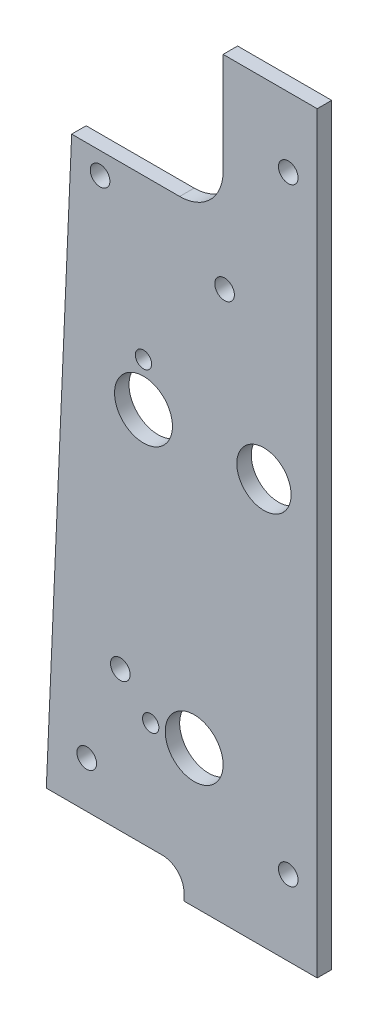
ISO-10303-21;
HEADER;
FILE_DESCRIPTION(('STEP AP214'),'2;1');
FILE_NAME('part.step','',(''),(''),'','','');
FILE_SCHEMA(('AUTOMOTIVE_DESIGN { 1 0 10303 214 1 1 1 1 }'));
ENDSEC;
DATA;
#1=APPLICATION_CONTEXT('core data for automotive mechanical design processes');
#2=APPLICATION_PROTOCOL_DEFINITION('international standard','automotive_design',2000,#1);
#3=PRODUCT_CONTEXT('',#1,'mechanical');
#4=PRODUCT('Part','Part','',(#3));
#5=PRODUCT_RELATED_PRODUCT_CATEGORY('part','',(#4));
#6=PRODUCT_DEFINITION_FORMATION('','',#4);
#7=PRODUCT_DEFINITION_CONTEXT('part definition',#1,'design');
#8=PRODUCT_DEFINITION('design','',#6,#7);
#9=PRODUCT_DEFINITION_SHAPE('','',#8);
#10=(LENGTH_UNIT() NAMED_UNIT(*) SI_UNIT(.MILLI.,.METRE.));
#11=(NAMED_UNIT(*) PLANE_ANGLE_UNIT() SI_UNIT($,.RADIAN.));
#12=(NAMED_UNIT(*) SI_UNIT($,.STERADIAN.) SOLID_ANGLE_UNIT());
#13=UNCERTAINTY_MEASURE_WITH_UNIT(LENGTH_MEASURE(1.E-05),#10,'distance_accuracy_value','');
#14=(GEOMETRIC_REPRESENTATION_CONTEXT(3) GLOBAL_UNCERTAINTY_ASSIGNED_CONTEXT((#13)) GLOBAL_UNIT_ASSIGNED_CONTEXT((#10,
#11,#12)) REPRESENTATION_CONTEXT('',''));
#15=CARTESIAN_POINT('',(0.,0.,0.));
#16=DIRECTION('',(0.,0.,1.));
#17=DIRECTION('',(1.,0.,0.));
#18=AXIS2_PLACEMENT_3D('',#15,#16,#17);
#19=CARTESIAN_POINT('',(-33.9725,1.58750000000002,-3.175));
#20=DIRECTION('',(0.,0.,1.));
#21=DIRECTION('',(1.,0.,0.));
#22=AXIS2_PLACEMENT_3D('',#19,#20,#21);
#23=CYLINDRICAL_SURFACE('',#22,4.7625);
#24=CARTESIAN_POINT('',(-33.9725,1.58750000000002,0.));
#25=DIRECTION('',(0.,0.,-1.));
#26=DIRECTION('',(1.,0.,0.));
#27=AXIS2_PLACEMENT_3D('',#24,#25,#26);
#28=CIRCLE('',#27,4.7625);
#29=CARTESIAN_POINT('',(-33.9725,6.35000000000002,0.));
#30=VERTEX_POINT('',#29);
#31=CARTESIAN_POINT('',(-29.21,1.58750000000002,0.));
#32=VERTEX_POINT('',#31);
#33=EDGE_CURVE('E206',#30,#32,#28,.T.);
#34=ORIENTED_EDGE('',*,*,#33,.F.);
#35=DIRECTION('',(0.,0.,1.));
#36=VECTOR('',#35,1.);
#37=CARTESIAN_POINT('',(-33.9725,6.35000000000002,-3.175));
#38=LINE('',#37,#36);
#39=CARTESIAN_POINT('',(-33.9725,6.35000000000002,-3.175));
#40=VERTEX_POINT('',#39);
#41=EDGE_CURVE('E165',#40,#30,#38,.T.);
#42=ORIENTED_EDGE('',*,*,#41,.F.);
#43=CARTESIAN_POINT('',(-33.9725,1.58750000000002,-3.175));
#44=DIRECTION('',(0.,0.,-1.));
#45=DIRECTION('',(1.,0.,0.));
#46=AXIS2_PLACEMENT_3D('',#43,#44,#45);
#47=CIRCLE('',#46,4.7625);
#48=CARTESIAN_POINT('',(-29.21,1.58750000000002,-3.175));
#49=VERTEX_POINT('',#48);
#50=EDGE_CURVE('E164',#40,#49,#47,.T.);
#51=ORIENTED_EDGE('',*,*,#50,.T.);
#52=DIRECTION('',(0.,0.,1.));
#53=VECTOR('',#52,1.);
#54=CARTESIAN_POINT('',(-29.21,1.58750000000002,-3.175));
#55=LINE('',#54,#53);
#56=EDGE_CURVE('E182',#49,#32,#55,.T.);
#57=ORIENTED_EDGE('',*,*,#56,.T.);
#58=EDGE_LOOP('',(#34,#42,#51,#57));
#59=FACE_BOUND('',#58,.T.);
#60=ADVANCED_FACE('F38',(#59),#23,.F.);
#61=CARTESIAN_POINT('',(-59.4118095238095,6.35000000000002,-3.175));
#62=DIRECTION('',(0.,-1.,0.));
#63=DIRECTION('',(1.,0.,0.));
#64=AXIS2_PLACEMENT_3D('',#61,#62,#63);
#65=PLANE('',#64);
#66=DIRECTION('',(1.,0.,0.));
#67=VECTOR('',#66,1.);
#68=CARTESIAN_POINT('',(-59.4118095238095,6.35000000000002,0.));
#69=LINE('',#68,#67);
#70=CARTESIAN_POINT('',(-59.4118095238095,6.35000000000002,0.));
#71=VERTEX_POINT('',#70);
#72=EDGE_CURVE('E160',#71,#30,#69,.T.);
#73=ORIENTED_EDGE('',*,*,#72,.F.);
#74=DIRECTION('',(0.,0.,1.));
#75=VECTOR('',#74,1.);
#76=CARTESIAN_POINT('',(-59.4118095238095,6.35000000000002,-3.175));
#77=LINE('',#76,#75);
#78=CARTESIAN_POINT('',(-59.4118095238095,6.35000000000002,-3.175));
#79=VERTEX_POINT('',#78);
#80=EDGE_CURVE('E168',#79,#71,#77,.T.);
#81=ORIENTED_EDGE('',*,*,#80,.F.);
#82=DIRECTION('',(1.,0.,0.));
#83=VECTOR('',#82,1.);
#84=CARTESIAN_POINT('',(-59.4118095238095,6.35000000000002,-3.175));
#85=LINE('',#84,#83);
#86=EDGE_CURVE('E185',#79,#40,#85,.T.);
#87=ORIENTED_EDGE('',*,*,#86,.T.);
#88=ORIENTED_EDGE('',*,*,#41,.T.);
#89=EDGE_LOOP('',(#73,#81,#87,#88));
#90=FACE_BOUND('',#89,.T.);
#91=ADVANCED_FACE('F326',(#90),#65,.T.);
#92=CARTESIAN_POINT('',(-53.848,133.35,-3.175));
#93=DIRECTION('',(-0.999041741961462,0.0437675429811689,0.));
#94=DIRECTION('',(-0.0437675429811689,-0.999041741961462,0.));
#95=AXIS2_PLACEMENT_3D('',#92,#93,#94);
#96=PLANE('',#95);
#97=DIRECTION('',(-0.0437675429811689,-0.999041741961462,0.));
#98=VECTOR('',#97,1.);
#99=CARTESIAN_POINT('',(-53.848,133.35,0.));
#100=LINE('',#99,#98);
#101=CARTESIAN_POINT('',(-53.848,133.35,0.));
#102=VERTEX_POINT('',#101);
#103=EDGE_CURVE('E150',#102,#71,#100,.T.);
#104=ORIENTED_EDGE('',*,*,#103,.F.);
#105=DIRECTION('',(0.,0.,1.));
#106=VECTOR('',#105,1.);
#107=CARTESIAN_POINT('',(-53.848,133.35,-3.175));
#108=LINE('',#107,#106);
#109=CARTESIAN_POINT('',(-53.848,133.35,-3.175));
#110=VERTEX_POINT('',#109);
#111=EDGE_CURVE('E171',#110,#102,#108,.T.);
#112=ORIENTED_EDGE('',*,*,#111,.F.);
#113=DIRECTION('',(-0.0437675429811689,-0.999041741961462,0.));
#114=VECTOR('',#113,1.);
#115=CARTESIAN_POINT('',(-53.848,133.35,-3.175));
#116=LINE('',#115,#114);
#117=EDGE_CURVE('E195',#110,#79,#116,.T.);
#118=ORIENTED_EDGE('',*,*,#117,.T.);
#119=ORIENTED_EDGE('',*,*,#80,.T.);
#120=EDGE_LOOP('',(#104,#112,#118,#119));
#121=FACE_BOUND('',#120,.T.);
#122=ADVANCED_FACE('F324',(#121),#96,.T.);
#123=CARTESIAN_POINT('',(-30.1625,133.35,-3.175));
#124=DIRECTION('',(0.,1.,0.));
#125=DIRECTION('',(0.,0.,1.));
#126=AXIS2_PLACEMENT_3D('',#123,#124,#125);
#127=PLANE('',#126);
#128=DIRECTION('',(-1.,0.,0.));
#129=VECTOR('',#128,1.);
#130=CARTESIAN_POINT('',(-30.1625,133.35,0.));
#131=LINE('',#130,#129);
#132=CARTESIAN_POINT('',(-30.1625,133.35,0.));
#133=VERTEX_POINT('',#132);
#134=EDGE_CURVE('E148',#133,#102,#131,.T.);
#135=ORIENTED_EDGE('',*,*,#134,.F.);
#136=DIRECTION('',(0.,0.,1.));
#137=VECTOR('',#136,1.);
#138=CARTESIAN_POINT('',(-30.1625,133.35,-3.175));
#139=LINE('',#138,#137);
#140=CARTESIAN_POINT('',(-30.1625,133.35,-3.175));
#141=VERTEX_POINT('',#140);
#142=EDGE_CURVE('E53',#133,#141,#139,.F.);
#143=ORIENTED_EDGE('',*,*,#142,.T.);
#144=DIRECTION('',(-1.,0.,0.));
#145=VECTOR('',#144,1.);
#146=CARTESIAN_POINT('',(-30.1625,133.35,-3.175));
#147=LINE('',#146,#145);
#148=EDGE_CURVE('E202',#141,#110,#147,.T.);
#149=ORIENTED_EDGE('',*,*,#148,.T.);
#150=ORIENTED_EDGE('',*,*,#111,.T.);
#151=EDGE_LOOP('',(#135,#143,#149,#150));
#152=FACE_BOUND('',#151,.T.);
#153=ADVANCED_FACE('F321',(#152),#127,.T.);
#154=CARTESIAN_POINT('',(0.,165.1,-3.175));
#155=DIRECTION('',(0.,1.,0.));
#156=DIRECTION('',(0.,0.,1.));
#157=AXIS2_PLACEMENT_3D('',#154,#155,#156);
#158=PLANE('',#157);
#159=DIRECTION('',(0.,0.,1.));
#160=VECTOR('',#159,1.);
#161=CARTESIAN_POINT('',(-20.6375,165.1,-3.176));
#162=LINE('',#161,#160);
#163=CARTESIAN_POINT('',(-20.6375,165.1,-3.175));
#164=VERTEX_POINT('',#163);
#165=CARTESIAN_POINT('',(-20.6375,165.1,0.));
#166=VERTEX_POINT('',#165);
#167=EDGE_CURVE('E126',#164,#166,#162,.T.);
#168=ORIENTED_EDGE('',*,*,#167,.T.);
#169=DIRECTION('',(-1.,0.,0.));
#170=VECTOR('',#169,1.);
#171=CARTESIAN_POINT('',(0.,165.1,0.));
#172=LINE('',#171,#170);
#173=CARTESIAN_POINT('',(0.,165.1,0.));
#174=VERTEX_POINT('',#173);
#175=EDGE_CURVE('E137',#174,#166,#172,.T.);
#176=ORIENTED_EDGE('',*,*,#175,.F.);
#177=DIRECTION('',(0.,0.,1.));
#178=VECTOR('',#177,1.);
#179=CARTESIAN_POINT('',(0.,165.1,-3.175));
#180=LINE('',#179,#178);
#181=CARTESIAN_POINT('',(0.,165.1,-3.175));
#182=VERTEX_POINT('',#181);
#183=EDGE_CURVE('E174',#182,#174,#180,.T.);
#184=ORIENTED_EDGE('',*,*,#183,.F.);
#185=DIRECTION('',(-1.,0.,0.));
#186=VECTOR('',#185,1.);
#187=CARTESIAN_POINT('',(0.,165.1,-3.175));
#188=LINE('',#187,#186);
#189=EDGE_CURVE('E140',#182,#164,#188,.T.);
#190=ORIENTED_EDGE('',*,*,#189,.T.);
#191=EDGE_LOOP('',(#168,#176,#184,#190));
#192=FACE_BOUND('',#191,.T.);
#193=ADVANCED_FACE('F136',(#192),#158,.T.);
#194=CARTESIAN_POINT('',(0.,0.,-3.175));
#195=DIRECTION('',(1.,0.,0.));
#196=DIRECTION('',(0.,0.,-1.));
#197=AXIS2_PLACEMENT_3D('',#194,#195,#196);
#198=PLANE('',#197);
#199=DIRECTION('',(0.,1.,0.));
#200=VECTOR('',#199,1.);
#201=CARTESIAN_POINT('',(0.,0.,0.));
#202=LINE('',#201,#200);
#203=CARTESIAN_POINT('',(0.,0.,0.));
#204=VERTEX_POINT('',#203);
#205=EDGE_CURVE('E147',#204,#174,#202,.T.);
#206=ORIENTED_EDGE('',*,*,#205,.F.);
#207=DIRECTION('',(0.,0.,1.));
#208=VECTOR('',#207,1.);
#209=CARTESIAN_POINT('',(0.,0.,-3.175));
#210=LINE('',#209,#208);
#211=CARTESIAN_POINT('',(0.,0.,-3.175));
#212=VERTEX_POINT('',#211);
#213=EDGE_CURVE('E176',#212,#204,#210,.T.);
#214=ORIENTED_EDGE('',*,*,#213,.F.);
#215=DIRECTION('',(0.,1.,0.));
#216=VECTOR('',#215,1.);
#217=CARTESIAN_POINT('',(0.,0.,-3.175));
#218=LINE('',#217,#216);
#219=EDGE_CURVE('E224',#212,#182,#218,.T.);
#220=ORIENTED_EDGE('',*,*,#219,.T.);
#221=ORIENTED_EDGE('',*,*,#183,.T.);
#222=EDGE_LOOP('',(#206,#214,#220,#221));
#223=FACE_BOUND('',#222,.T.);
#224=ADVANCED_FACE('F223',(#223),#198,.T.);
#225=CARTESIAN_POINT('',(-29.21,0.,-3.175));
#226=DIRECTION('',(0.,-1.,0.));
#227=DIRECTION('',(0.,0.,-1.));
#228=AXIS2_PLACEMENT_3D('',#225,#226,#227);
#229=PLANE('',#228);
#230=DIRECTION('',(1.,0.,0.));
#231=VECTOR('',#230,1.);
#232=CARTESIAN_POINT('',(-29.21,0.,0.));
#233=LINE('',#232,#231);
#234=CARTESIAN_POINT('',(-29.21,0.,0.));
#235=VERTEX_POINT('',#234);
#236=EDGE_CURVE('E153',#235,#204,#233,.T.);
#237=ORIENTED_EDGE('',*,*,#236,.F.);
#238=DIRECTION('',(0.,0.,1.));
#239=VECTOR('',#238,1.);
#240=CARTESIAN_POINT('',(-29.21,0.,-3.175));
#241=LINE('',#240,#239);
#242=CARTESIAN_POINT('',(-29.21,0.,-3.175));
#243=VERTEX_POINT('',#242);
#244=EDGE_CURVE('E179',#243,#235,#241,.T.);
#245=ORIENTED_EDGE('',*,*,#244,.F.);
#246=DIRECTION('',(1.,0.,0.));
#247=VECTOR('',#246,1.);
#248=CARTESIAN_POINT('',(-29.21,0.,-3.175));
#249=LINE('',#248,#247);
#250=EDGE_CURVE('E219',#243,#212,#249,.T.);
#251=ORIENTED_EDGE('',*,*,#250,.T.);
#252=ORIENTED_EDGE('',*,*,#213,.T.);
#253=EDGE_LOOP('',(#237,#245,#251,#252));
#254=FACE_BOUND('',#253,.T.);
#255=ADVANCED_FACE('F216',(#254),#229,.T.);
#256=CARTESIAN_POINT('',(-29.21,1.58750000000002,-3.175));
#257=DIRECTION('',(-1.,0.,0.));
#258=DIRECTION('',(0.,0.,1.));
#259=AXIS2_PLACEMENT_3D('',#256,#257,#258);
#260=PLANE('',#259);
#261=DIRECTION('',(0.,-1.,0.));
#262=VECTOR('',#261,1.);
#263=CARTESIAN_POINT('',(-29.21,1.58750000000002,0.));
#264=LINE('',#263,#262);
#265=EDGE_CURVE('E210',#32,#235,#264,.T.);
#266=ORIENTED_EDGE('',*,*,#265,.F.);
#267=ORIENTED_EDGE('',*,*,#56,.F.);
#268=DIRECTION('',(0.,-1.,0.));
#269=VECTOR('',#268,1.);
#270=CARTESIAN_POINT('',(-29.21,1.58750000000002,-3.175));
#271=LINE('',#270,#269);
#272=EDGE_CURVE('E232',#49,#243,#271,.T.);
#273=ORIENTED_EDGE('',*,*,#272,.T.);
#274=ORIENTED_EDGE('',*,*,#244,.T.);
#275=EDGE_LOOP('',(#266,#267,#273,#274));
#276=FACE_BOUND('',#275,.T.);
#277=ADVANCED_FACE('F334',(#276),#260,.T.);
#278=CARTESIAN_POINT('',(-33.9725,1.58750000000002,-3.175));
#279=DIRECTION('',(0.,0.,1.));
#280=DIRECTION('',(1.,0.,0.));
#281=AXIS2_PLACEMENT_3D('',#278,#279,#280);
#282=PLANE('',#281);
#283=CARTESIAN_POINT('',(-38.1,88.9,-3.175));
#284=DIRECTION('',(0.,0.,1.));
#285=DIRECTION('',(1.,0.,0.));
#286=AXIS2_PLACEMENT_3D('',#283,#284,#285);
#287=CIRCLE('',#286,6.34999999999999);
#288=CARTESIAN_POINT('',(-31.75,88.9,-3.175));
#289=VERTEX_POINT('',#288);
#290=EDGE_CURVE('E310',#289,#289,#287,.T.);
#291=ORIENTED_EDGE('',*,*,#290,.T.);
#292=EDGE_LOOP('',(#291));
#293=FACE_BOUND('',#292,.T.);
#294=CARTESIAN_POINT('',(-26.9875,30.1625,-3.175));
#295=DIRECTION('',(0.,0.,1.));
#296=DIRECTION('',(1.,0.,0.));
#297=AXIS2_PLACEMENT_3D('',#294,#295,#296);
#298=CIRCLE('',#297,6.34999999999999);
#299=CARTESIAN_POINT('',(-20.6375,30.1625,-3.175));
#300=VERTEX_POINT('',#299);
#301=EDGE_CURVE('E302',#300,#300,#298,.T.);
#302=ORIENTED_EDGE('',*,*,#301,.T.);
#303=EDGE_LOOP('',(#302));
#304=FACE_BOUND('',#303,.T.);
#305=CARTESIAN_POINT('',(-11.684,88.9,-3.175));
#306=DIRECTION('',(0.,0.,1.));
#307=DIRECTION('',(1.,0.,0.));
#308=AXIS2_PLACEMENT_3D('',#305,#306,#307);
#309=CIRCLE('',#308,5.953125);
#310=CARTESIAN_POINT('',(-5.730875,88.9,-3.175));
#311=VERTEX_POINT('',#310);
#312=EDGE_CURVE('E294',#311,#311,#309,.T.);
#313=ORIENTED_EDGE('',*,*,#312,.T.);
#314=EDGE_LOOP('',(#313));
#315=FACE_BOUND('',#314,.T.);
#316=CARTESIAN_POINT('',(-38.1,98.425,-3.175));
#317=DIRECTION('',(0.,0.,1.));
#318=DIRECTION('',(1.,0.,0.));
#319=AXIS2_PLACEMENT_3D('',#316,#317,#318);
#320=CIRCLE('',#319,1.786001);
#321=CARTESIAN_POINT('',(-36.313999,98.425,-3.175));
#322=VERTEX_POINT('',#321);
#323=EDGE_CURVE('E286',#322,#322,#320,.T.);
#324=ORIENTED_EDGE('',*,*,#323,.T.);
#325=EDGE_LOOP('',(#324));
#326=FACE_BOUND('',#325,.T.);
#327=CARTESIAN_POINT('',(-36.5125,30.1625,-3.175));
#328=DIRECTION('',(0.,0.,1.));
#329=DIRECTION('',(1.,0.,0.));
#330=AXIS2_PLACEMENT_3D('',#327,#328,#329);
#331=CIRCLE('',#330,1.786001);
#332=CARTESIAN_POINT('',(-34.726499,30.1625,-3.175));
#333=VERTEX_POINT('',#332);
#334=EDGE_CURVE('E279',#333,#333,#331,.T.);
#335=ORIENTED_EDGE('',*,*,#334,.T.);
#336=EDGE_LOOP('',(#335));
#337=FACE_BOUND('',#336,.T.);
#338=CARTESIAN_POINT('',(-43.18,37.084,-3.175));
#339=DIRECTION('',(0.,0.,1.));
#340=DIRECTION('',(1.,0.,0.));
#341=AXIS2_PLACEMENT_3D('',#338,#339,#340);
#342=CIRCLE('',#341,2.15265);
#343=CARTESIAN_POINT('',(-41.02735,37.084,-3.175));
#344=VERTEX_POINT('',#343);
#345=EDGE_CURVE('E271',#344,#344,#342,.T.);
#346=ORIENTED_EDGE('',*,*,#345,.T.);
#347=EDGE_LOOP('',(#346));
#348=FACE_BOUND('',#347,.T.);
#349=CARTESIAN_POINT('',(-20.32,120.65,-3.175));
#350=DIRECTION('',(0.,0.,1.));
#351=DIRECTION('',(1.,0.,0.));
#352=AXIS2_PLACEMENT_3D('',#349,#350,#351);
#353=CIRCLE('',#352,2.15265);
#354=CARTESIAN_POINT('',(-18.16735,120.65,-3.175));
#355=VERTEX_POINT('',#354);
#356=EDGE_CURVE('E265',#355,#355,#353,.T.);
#357=ORIENTED_EDGE('',*,*,#356,.T.);
#358=EDGE_LOOP('',(#357));
#359=FACE_BOUND('',#358,.T.);
#360=CARTESIAN_POINT('',(-47.625,128.5875,-3.175));
#361=DIRECTION('',(0.,0.,1.));
#362=DIRECTION('',(1.,0.,0.));
#363=AXIS2_PLACEMENT_3D('',#360,#361,#362);
#364=CIRCLE('',#363,2.15265);
#365=CARTESIAN_POINT('',(-45.47235,128.5875,-3.175));
#366=VERTEX_POINT('',#365);
#367=EDGE_CURVE('E259',#366,#366,#364,.T.);
#368=ORIENTED_EDGE('',*,*,#367,.T.);
#369=EDGE_LOOP('',(#368));
#370=FACE_BOUND('',#369,.T.);
#371=CARTESIAN_POINT('',(-6.34999999999997,149.86,-3.175));
#372=DIRECTION('',(0.,0.,1.));
#373=DIRECTION('',(1.,0.,0.));
#374=AXIS2_PLACEMENT_3D('',#371,#372,#373);
#375=CIRCLE('',#374,2.15265);
#376=CARTESIAN_POINT('',(-4.19734999999998,149.86,-3.175));
#377=VERTEX_POINT('',#376);
#378=EDGE_CURVE('E253',#377,#377,#375,.T.);
#379=ORIENTED_EDGE('',*,*,#378,.T.);
#380=EDGE_LOOP('',(#379));
#381=FACE_BOUND('',#380,.T.);
#382=CARTESIAN_POINT('',(-50.546,16.51,-3.175));
#383=DIRECTION('',(0.,0.,1.));
#384=DIRECTION('',(1.,0.,0.));
#385=AXIS2_PLACEMENT_3D('',#382,#383,#384);
#386=CIRCLE('',#385,2.15265);
#387=CARTESIAN_POINT('',(-48.39335,16.51,-3.175));
#388=VERTEX_POINT('',#387);
#389=EDGE_CURVE('E245',#388,#388,#386,.T.);
#390=ORIENTED_EDGE('',*,*,#389,.T.);
#391=EDGE_LOOP('',(#390));
#392=FACE_BOUND('',#391,.T.);
#393=CARTESIAN_POINT('',(-6.35,16.51,-3.175));
#394=DIRECTION('',(0.,0.,1.));
#395=DIRECTION('',(1.,0.,0.));
#396=AXIS2_PLACEMENT_3D('',#393,#394,#395);
#397=CIRCLE('',#396,2.15265);
#398=CARTESIAN_POINT('',(-4.19735,16.51,-3.175));
#399=VERTEX_POINT('',#398);
#400=EDGE_CURVE('E211',#399,#399,#397,.T.);
#401=ORIENTED_EDGE('',*,*,#400,.T.);
#402=EDGE_LOOP('',(#401));
#403=FACE_BOUND('',#402,.T.);
#404=ORIENTED_EDGE('',*,*,#148,.F.);
#405=CARTESIAN_POINT('',(-30.1625,142.875,-3.175));
#406=DIRECTION('',(0.,0.,1.));
#407=DIRECTION('',(1.,0.,0.));
#408=AXIS2_PLACEMENT_3D('',#405,#406,#407);
#409=CIRCLE('',#408,9.525);
#410=CARTESIAN_POINT('',(-20.6375,142.875,-3.175));
#411=VERTEX_POINT('',#410);
#412=EDGE_CURVE('E11',#141,#411,#409,.T.);
#413=ORIENTED_EDGE('',*,*,#412,.T.);
#414=DIRECTION('',(0.,-1.,0.));
#415=VECTOR('',#414,1.);
#416=CARTESIAN_POINT('',(-20.6375,165.1,-3.175));
#417=LINE('',#416,#415);
#418=EDGE_CURVE('E131',#164,#411,#417,.T.);
#419=ORIENTED_EDGE('',*,*,#418,.F.);
#420=ORIENTED_EDGE('',*,*,#189,.F.);
#421=ORIENTED_EDGE('',*,*,#219,.F.);
#422=ORIENTED_EDGE('',*,*,#250,.F.);
#423=ORIENTED_EDGE('',*,*,#272,.F.);
#424=ORIENTED_EDGE('',*,*,#50,.F.);
#425=ORIENTED_EDGE('',*,*,#86,.F.);
#426=ORIENTED_EDGE('',*,*,#117,.F.);
#427=EDGE_LOOP('',(#404,#413,#419,#420,#421,#422,#423,#424,#425,#426));
#428=FACE_BOUND('',#427,.T.);
#429=ADVANCED_FACE('F226',(#293,#304,#315,#326,#337,#348,#359,#370,#381,#392,#403,#428),#282,.F.);
#430=CARTESIAN_POINT('',(-33.9725,1.58750000000002,0.));
#431=DIRECTION('',(0.,0.,1.));
#432=DIRECTION('',(1.,0.,0.));
#433=AXIS2_PLACEMENT_3D('',#430,#431,#432);
#434=PLANE('',#433);
#435=DIRECTION('',(0.,1.,0.));
#436=VECTOR('',#435,1.);
#437=CARTESIAN_POINT('',(-20.6375,165.1,0.));
#438=LINE('',#437,#436);
#439=CARTESIAN_POINT('',(-20.6375,142.875,0.));
#440=VERTEX_POINT('',#439);
#441=EDGE_CURVE('E122',#440,#166,#438,.T.);
#442=ORIENTED_EDGE('',*,*,#441,.F.);
#443=CARTESIAN_POINT('',(-30.1625,142.875,0.));
#444=DIRECTION('',(0.,0.,1.));
#445=DIRECTION('',(1.,0.,0.));
#446=AXIS2_PLACEMENT_3D('',#443,#444,#445);
#447=CIRCLE('',#446,9.525);
#448=EDGE_CURVE('E46',#440,#133,#447,.F.);
#449=ORIENTED_EDGE('',*,*,#448,.T.);
#450=ORIENTED_EDGE('',*,*,#134,.T.);
#451=ORIENTED_EDGE('',*,*,#103,.T.);
#452=ORIENTED_EDGE('',*,*,#72,.T.);
#453=ORIENTED_EDGE('',*,*,#33,.T.);
#454=ORIENTED_EDGE('',*,*,#265,.T.);
#455=ORIENTED_EDGE('',*,*,#236,.T.);
#456=ORIENTED_EDGE('',*,*,#205,.T.);
#457=ORIENTED_EDGE('',*,*,#175,.T.);
#458=EDGE_LOOP('',(#442,#449,#450,#451,#452,#453,#454,#455,#456,#457));
#459=FACE_BOUND('',#458,.T.);
#460=CARTESIAN_POINT('',(-38.1,88.9,0.));
#461=DIRECTION('',(0.,0.,1.));
#462=DIRECTION('',(1.,0.,0.));
#463=AXIS2_PLACEMENT_3D('',#460,#461,#462);
#464=CIRCLE('',#463,6.34999999999999);
#465=CARTESIAN_POINT('',(-31.75,88.9,0.));
#466=VERTEX_POINT('',#465);
#467=EDGE_CURVE('E141',#466,#466,#464,.T.);
#468=ORIENTED_EDGE('',*,*,#467,.F.);
#469=EDGE_LOOP('',(#468));
#470=FACE_BOUND('',#469,.T.);
#471=CARTESIAN_POINT('',(-26.9875,30.1625,0.));
#472=DIRECTION('',(0.,0.,1.));
#473=DIRECTION('',(1.,0.,0.));
#474=AXIS2_PLACEMENT_3D('',#471,#472,#473);
#475=CIRCLE('',#474,6.34999999999999);
#476=CARTESIAN_POINT('',(-20.6375,30.1625,0.));
#477=VERTEX_POINT('',#476);
#478=EDGE_CURVE('E306',#477,#477,#475,.T.);
#479=ORIENTED_EDGE('',*,*,#478,.F.);
#480=EDGE_LOOP('',(#479));
#481=FACE_BOUND('',#480,.T.);
#482=CARTESIAN_POINT('',(-11.684,88.9,0.));
#483=DIRECTION('',(0.,0.,1.));
#484=DIRECTION('',(1.,0.,0.));
#485=AXIS2_PLACEMENT_3D('',#482,#483,#484);
#486=CIRCLE('',#485,5.953125);
#487=CARTESIAN_POINT('',(-5.730875,88.9,0.));
#488=VERTEX_POINT('',#487);
#489=EDGE_CURVE('E298',#488,#488,#486,.T.);
#490=ORIENTED_EDGE('',*,*,#489,.F.);
#491=EDGE_LOOP('',(#490));
#492=FACE_BOUND('',#491,.T.);
#493=CARTESIAN_POINT('',(-38.1,98.425,0.));
#494=DIRECTION('',(0.,0.,1.));
#495=DIRECTION('',(1.,0.,0.));
#496=AXIS2_PLACEMENT_3D('',#493,#494,#495);
#497=CIRCLE('',#496,1.786001);
#498=CARTESIAN_POINT('',(-36.313999,98.425,0.));
#499=VERTEX_POINT('',#498);
#500=EDGE_CURVE('E290',#499,#499,#497,.T.);
#501=ORIENTED_EDGE('',*,*,#500,.F.);
#502=EDGE_LOOP('',(#501));
#503=FACE_BOUND('',#502,.T.);
#504=CARTESIAN_POINT('',(-36.5125,30.1625,0.));
#505=DIRECTION('',(0.,0.,1.));
#506=DIRECTION('',(1.,0.,0.));
#507=AXIS2_PLACEMENT_3D('',#504,#505,#506);
#508=CIRCLE('',#507,1.786001);
#509=CARTESIAN_POINT('',(-34.726499,30.1625,0.));
#510=VERTEX_POINT('',#509);
#511=EDGE_CURVE('E282',#510,#510,#508,.T.);
#512=ORIENTED_EDGE('',*,*,#511,.F.);
#513=EDGE_LOOP('',(#512));
#514=FACE_BOUND('',#513,.T.);
#515=CARTESIAN_POINT('',(-43.18,37.084,0.));
#516=DIRECTION('',(0.,0.,1.));
#517=DIRECTION('',(1.,0.,0.));
#518=AXIS2_PLACEMENT_3D('',#515,#516,#517);
#519=CIRCLE('',#518,2.15264999999999);
#520=CARTESIAN_POINT('',(-41.02735,37.084,0.));
#521=VERTEX_POINT('',#520);
#522=EDGE_CURVE('E275',#521,#521,#519,.T.);
#523=ORIENTED_EDGE('',*,*,#522,.F.);
#524=EDGE_LOOP('',(#523));
#525=FACE_BOUND('',#524,.T.);
#526=CARTESIAN_POINT('',(-20.32,120.65,0.));
#527=DIRECTION('',(0.,0.,1.));
#528=DIRECTION('',(1.,0.,0.));
#529=AXIS2_PLACEMENT_3D('',#526,#527,#528);
#530=CIRCLE('',#529,2.15264999999999);
#531=CARTESIAN_POINT('',(-18.16735,120.65,0.));
#532=VERTEX_POINT('',#531);
#533=EDGE_CURVE('E268',#532,#532,#530,.T.);
#534=ORIENTED_EDGE('',*,*,#533,.F.);
#535=EDGE_LOOP('',(#534));
#536=FACE_BOUND('',#535,.T.);
#537=CARTESIAN_POINT('',(-47.625,128.5875,0.));
#538=DIRECTION('',(0.,0.,1.));
#539=DIRECTION('',(1.,0.,0.));
#540=AXIS2_PLACEMENT_3D('',#537,#538,#539);
#541=CIRCLE('',#540,2.15264999999999);
#542=CARTESIAN_POINT('',(-45.47235,128.5875,0.));
#543=VERTEX_POINT('',#542);
#544=EDGE_CURVE('E262',#543,#543,#541,.T.);
#545=ORIENTED_EDGE('',*,*,#544,.F.);
#546=EDGE_LOOP('',(#545));
#547=FACE_BOUND('',#546,.T.);
#548=CARTESIAN_POINT('',(-6.34999999999997,149.86,0.));
#549=DIRECTION('',(0.,0.,1.));
#550=DIRECTION('',(1.,0.,0.));
#551=AXIS2_PLACEMENT_3D('',#548,#549,#550);
#552=CIRCLE('',#551,2.15264999999999);
#553=CARTESIAN_POINT('',(-4.19734999999999,149.86,0.));
#554=VERTEX_POINT('',#553);
#555=EDGE_CURVE('E256',#554,#554,#552,.T.);
#556=ORIENTED_EDGE('',*,*,#555,.F.);
#557=EDGE_LOOP('',(#556));
#558=FACE_BOUND('',#557,.T.);
#559=CARTESIAN_POINT('',(-50.546,16.51,0.));
#560=DIRECTION('',(0.,0.,1.));
#561=DIRECTION('',(1.,0.,0.));
#562=AXIS2_PLACEMENT_3D('',#559,#560,#561);
#563=CIRCLE('',#562,2.15264999999999);
#564=CARTESIAN_POINT('',(-48.39335,16.51,0.));
#565=VERTEX_POINT('',#564);
#566=EDGE_CURVE('E249',#565,#565,#563,.T.);
#567=ORIENTED_EDGE('',*,*,#566,.F.);
#568=EDGE_LOOP('',(#567));
#569=FACE_BOUND('',#568,.T.);
#570=CARTESIAN_POINT('',(-6.35,16.51,0.));
#571=DIRECTION('',(0.,0.,1.));
#572=DIRECTION('',(1.,0.,0.));
#573=AXIS2_PLACEMENT_3D('',#570,#571,#572);
#574=CIRCLE('',#573,2.15264999999999);
#575=CARTESIAN_POINT('',(-4.19735000000001,16.51,0.));
#576=VERTEX_POINT('',#575);
#577=EDGE_CURVE('E241',#576,#576,#574,.T.);
#578=ORIENTED_EDGE('',*,*,#577,.F.);
#579=EDGE_LOOP('',(#578));
#580=FACE_BOUND('',#579,.T.);
#581=ADVANCED_FACE('F143',(#459,#470,#481,#492,#503,#514,#525,#536,#547,#558,#569,#580),#434,.T.);
#582=CARTESIAN_POINT('',(-6.35,16.51,0.));
#583=DIRECTION('',(0.,0.,1.));
#584=DIRECTION('',(1.,0.,0.));
#585=AXIS2_PLACEMENT_3D('',#582,#583,#584);
#586=CYLINDRICAL_SURFACE('',#585,2.15264999999999);
#587=ORIENTED_EDGE('',*,*,#400,.F.);
#588=EDGE_LOOP('',(#587));
#589=FACE_BOUND('',#588,.T.);
#590=ORIENTED_EDGE('',*,*,#577,.T.);
#591=EDGE_LOOP('',(#590));
#592=FACE_BOUND('',#591,.T.);
#593=ADVANCED_FACE('F350',(#589,#592),#586,.F.);
#594=CARTESIAN_POINT('',(-50.546,16.51,0.));
#595=DIRECTION('',(0.,0.,1.));
#596=DIRECTION('',(1.,0.,0.));
#597=AXIS2_PLACEMENT_3D('',#594,#595,#596);
#598=CYLINDRICAL_SURFACE('',#597,2.15264999999999);
#599=ORIENTED_EDGE('',*,*,#389,.F.);
#600=EDGE_LOOP('',(#599));
#601=FACE_BOUND('',#600,.T.);
#602=ORIENTED_EDGE('',*,*,#566,.T.);
#603=EDGE_LOOP('',(#602));
#604=FACE_BOUND('',#603,.T.);
#605=ADVANCED_FACE('F356',(#601,#604),#598,.F.);
#606=CARTESIAN_POINT('',(-6.34999999999997,149.86,0.));
#607=DIRECTION('',(0.,0.,1.));
#608=DIRECTION('',(1.,0.,0.));
#609=AXIS2_PLACEMENT_3D('',#606,#607,#608);
#610=CYLINDRICAL_SURFACE('',#609,2.15264999999999);
#611=ORIENTED_EDGE('',*,*,#378,.F.);
#612=EDGE_LOOP('',(#611));
#613=FACE_BOUND('',#612,.T.);
#614=ORIENTED_EDGE('',*,*,#555,.T.);
#615=EDGE_LOOP('',(#614));
#616=FACE_BOUND('',#615,.T.);
#617=ADVANCED_FACE('F360',(#613,#616),#610,.F.);
#618=CARTESIAN_POINT('',(-47.625,128.5875,0.));
#619=DIRECTION('',(0.,0.,1.));
#620=DIRECTION('',(1.,0.,0.));
#621=AXIS2_PLACEMENT_3D('',#618,#619,#620);
#622=CYLINDRICAL_SURFACE('',#621,2.15265);
#623=ORIENTED_EDGE('',*,*,#367,.F.);
#624=EDGE_LOOP('',(#623));
#625=FACE_BOUND('',#624,.T.);
#626=ORIENTED_EDGE('',*,*,#544,.T.);
#627=EDGE_LOOP('',(#626));
#628=FACE_BOUND('',#627,.T.);
#629=ADVANCED_FACE('F364',(#625,#628),#622,.F.);
#630=CARTESIAN_POINT('',(-20.32,120.65,0.));
#631=DIRECTION('',(0.,0.,1.));
#632=DIRECTION('',(1.,0.,0.));
#633=AXIS2_PLACEMENT_3D('',#630,#631,#632);
#634=CYLINDRICAL_SURFACE('',#633,2.15264999999999);
#635=ORIENTED_EDGE('',*,*,#356,.F.);
#636=EDGE_LOOP('',(#635));
#637=FACE_BOUND('',#636,.T.);
#638=ORIENTED_EDGE('',*,*,#533,.T.);
#639=EDGE_LOOP('',(#638));
#640=FACE_BOUND('',#639,.T.);
#641=ADVANCED_FACE('F368',(#637,#640),#634,.F.);
#642=CARTESIAN_POINT('',(-43.18,37.084,0.));
#643=DIRECTION('',(0.,0.,1.));
#644=DIRECTION('',(1.,0.,0.));
#645=AXIS2_PLACEMENT_3D('',#642,#643,#644);
#646=CYLINDRICAL_SURFACE('',#645,2.15265);
#647=ORIENTED_EDGE('',*,*,#345,.F.);
#648=EDGE_LOOP('',(#647));
#649=FACE_BOUND('',#648,.T.);
#650=ORIENTED_EDGE('',*,*,#522,.T.);
#651=EDGE_LOOP('',(#650));
#652=FACE_BOUND('',#651,.T.);
#653=ADVANCED_FACE('F372',(#649,#652),#646,.F.);
#654=CARTESIAN_POINT('',(-36.5125,30.1625,0.));
#655=DIRECTION('',(0.,0.,1.));
#656=DIRECTION('',(1.,0.,0.));
#657=AXIS2_PLACEMENT_3D('',#654,#655,#656);
#658=CYLINDRICAL_SURFACE('',#657,1.786001);
#659=ORIENTED_EDGE('',*,*,#334,.F.);
#660=EDGE_LOOP('',(#659));
#661=FACE_BOUND('',#660,.T.);
#662=ORIENTED_EDGE('',*,*,#511,.T.);
#663=EDGE_LOOP('',(#662));
#664=FACE_BOUND('',#663,.T.);
#665=ADVANCED_FACE('F376',(#661,#664),#658,.F.);
#666=CARTESIAN_POINT('',(-38.1,98.425,0.));
#667=DIRECTION('',(0.,0.,1.));
#668=DIRECTION('',(1.,0.,0.));
#669=AXIS2_PLACEMENT_3D('',#666,#667,#668);
#670=CYLINDRICAL_SURFACE('',#669,1.786001);
#671=ORIENTED_EDGE('',*,*,#323,.F.);
#672=EDGE_LOOP('',(#671));
#673=FACE_BOUND('',#672,.T.);
#674=ORIENTED_EDGE('',*,*,#500,.T.);
#675=EDGE_LOOP('',(#674));
#676=FACE_BOUND('',#675,.T.);
#677=ADVANCED_FACE('F380',(#673,#676),#670,.F.);
#678=CARTESIAN_POINT('',(-11.684,88.9,0.));
#679=DIRECTION('',(0.,0.,1.));
#680=DIRECTION('',(1.,0.,0.));
#681=AXIS2_PLACEMENT_3D('',#678,#679,#680);
#682=CYLINDRICAL_SURFACE('',#681,5.953125);
#683=ORIENTED_EDGE('',*,*,#312,.F.);
#684=EDGE_LOOP('',(#683));
#685=FACE_BOUND('',#684,.T.);
#686=ORIENTED_EDGE('',*,*,#489,.T.);
#687=EDGE_LOOP('',(#686));
#688=FACE_BOUND('',#687,.T.);
#689=ADVANCED_FACE('F384',(#685,#688),#682,.F.);
#690=CARTESIAN_POINT('',(-26.9875,30.1625,0.));
#691=DIRECTION('',(0.,0.,1.));
#692=DIRECTION('',(1.,0.,0.));
#693=AXIS2_PLACEMENT_3D('',#690,#691,#692);
#694=CYLINDRICAL_SURFACE('',#693,6.34999999999999);
#695=ORIENTED_EDGE('',*,*,#301,.F.);
#696=EDGE_LOOP('',(#695));
#697=FACE_BOUND('',#696,.T.);
#698=ORIENTED_EDGE('',*,*,#478,.T.);
#699=EDGE_LOOP('',(#698));
#700=FACE_BOUND('',#699,.T.);
#701=ADVANCED_FACE('F388',(#697,#700),#694,.F.);
#702=CARTESIAN_POINT('',(-38.1,88.9,0.));
#703=DIRECTION('',(0.,0.,1.));
#704=DIRECTION('',(1.,0.,0.));
#705=AXIS2_PLACEMENT_3D('',#702,#703,#704);
#706=CYLINDRICAL_SURFACE('',#705,6.34999999999999);
#707=ORIENTED_EDGE('',*,*,#290,.F.);
#708=EDGE_LOOP('',(#707));
#709=FACE_BOUND('',#708,.T.);
#710=ORIENTED_EDGE('',*,*,#467,.T.);
#711=EDGE_LOOP('',(#710));
#712=FACE_BOUND('',#711,.T.);
#713=ADVANCED_FACE('F392',(#709,#712),#706,.F.);
#714=CARTESIAN_POINT('',(-20.6375,165.1,-3.176));
#715=DIRECTION('',(1.,0.,0.));
#716=DIRECTION('',(0.,1.,0.));
#717=AXIS2_PLACEMENT_3D('',#714,#715,#716);
#718=PLANE('',#717);
#719=ORIENTED_EDGE('',*,*,#418,.T.);
#720=DIRECTION('',(0.,0.,1.));
#721=VECTOR('',#720,1.);
#722=CARTESIAN_POINT('',(-20.6375,142.875,-3.176));
#723=LINE('',#722,#721);
#724=EDGE_CURVE('E129',#411,#440,#723,.T.);
#725=ORIENTED_EDGE('',*,*,#724,.T.);
#726=ORIENTED_EDGE('',*,*,#441,.T.);
#727=ORIENTED_EDGE('',*,*,#167,.F.);
#728=EDGE_LOOP('',(#719,#725,#726,#727));
#729=FACE_BOUND('',#728,.T.);
#730=ADVANCED_FACE('F125',(#729),#718,.F.);
#731=CARTESIAN_POINT('',(-30.1625,142.875,-3.176));
#732=DIRECTION('',(0.,0.,1.));
#733=DIRECTION('',(1.,0.,0.));
#734=AXIS2_PLACEMENT_3D('',#731,#732,#733);
#735=CYLINDRICAL_SURFACE('',#734,9.525);
#736=ORIENTED_EDGE('',*,*,#412,.F.);
#737=ORIENTED_EDGE('',*,*,#142,.F.);
#738=ORIENTED_EDGE('',*,*,#448,.F.);
#739=ORIENTED_EDGE('',*,*,#724,.F.);
#740=EDGE_LOOP('',(#736,#737,#738,#739));
#741=FACE_BOUND('',#740,.T.);
#742=ADVANCED_FACE('F40',(#741),#735,.F.);
#743=CLOSED_SHELL('',(#60,#91,#122,#153,#193,#224,#255,#277,#429,#581,#593,#605,#617,#629,#641,
#653,#665,#677,#689,#701,#713,#730,#742));
#744=MANIFOLD_SOLID_BREP('B2',#743);
#745=ADVANCED_BREP_SHAPE_REPRESENTATION('',(#18,#744),#14);
#746=SHAPE_DEFINITION_REPRESENTATION(#9,#745);
ENDSEC;
END-ISO-10303-21;
